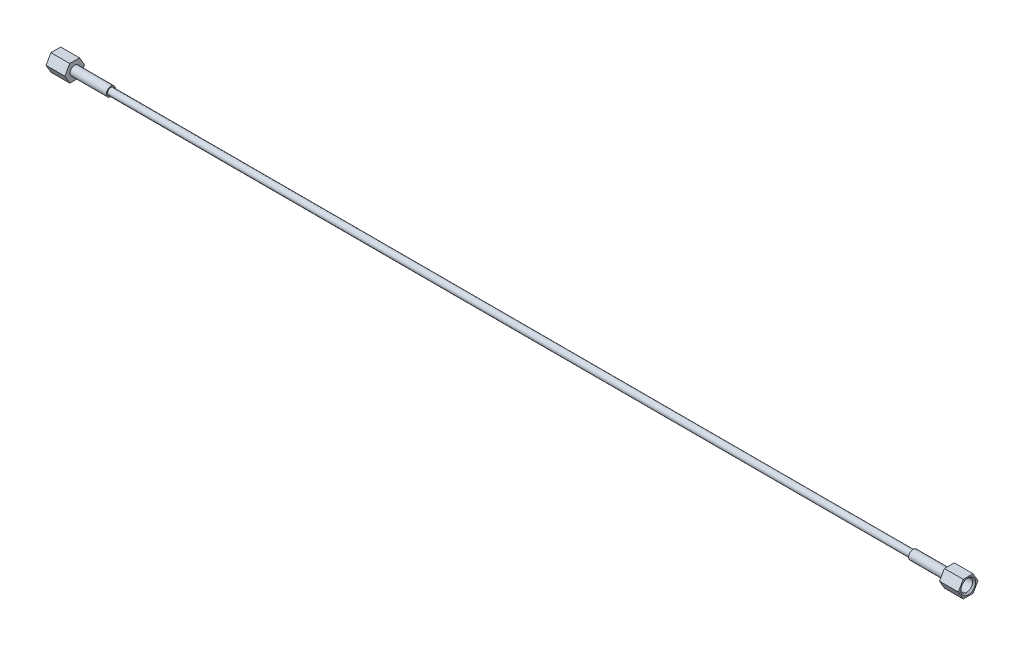
ISO-10303-21;
HEADER;
FILE_DESCRIPTION(('STEP AP214'),'2;1');
FILE_NAME('part.step','',(''),(''),'','','');
FILE_SCHEMA(('AUTOMOTIVE_DESIGN { 1 0 10303 214 1 1 1 1 }'));
ENDSEC;
DATA;
#1=APPLICATION_CONTEXT('core data for automotive mechanical design processes');
#2=APPLICATION_PROTOCOL_DEFINITION('international standard','automotive_design',2000,#1);
#3=PRODUCT_CONTEXT('',#1,'mechanical');
#4=PRODUCT('Part','Part','',(#3));
#5=PRODUCT_RELATED_PRODUCT_CATEGORY('part','',(#4));
#6=PRODUCT_DEFINITION_FORMATION('','',#4);
#7=PRODUCT_DEFINITION_CONTEXT('part definition',#1,'design');
#8=PRODUCT_DEFINITION('design','',#6,#7);
#9=PRODUCT_DEFINITION_SHAPE('','',#8);
#10=(LENGTH_UNIT() NAMED_UNIT(*) SI_UNIT(.MILLI.,.METRE.));
#11=(NAMED_UNIT(*) PLANE_ANGLE_UNIT() SI_UNIT($,.RADIAN.));
#12=(NAMED_UNIT(*) SI_UNIT($,.STERADIAN.) SOLID_ANGLE_UNIT());
#13=UNCERTAINTY_MEASURE_WITH_UNIT(LENGTH_MEASURE(1.E-05),#10,'distance_accuracy_value','');
#14=(GEOMETRIC_REPRESENTATION_CONTEXT(3) GLOBAL_UNCERTAINTY_ASSIGNED_CONTEXT((#13)) GLOBAL_UNIT_ASSIGNED_CONTEXT((#10,
#11,#12)) REPRESENTATION_CONTEXT('',''));
#15=CARTESIAN_POINT('',(0.,0.,0.));
#16=DIRECTION('',(0.,0.,1.));
#17=DIRECTION('',(1.,0.,0.));
#18=AXIS2_PLACEMENT_3D('',#15,#16,#17);
#19=CARTESIAN_POINT('',(-753.11,0.,-8.21223022895325));
#20=DIRECTION('',(0.,-0.500000000000001,0.866025403784438));
#21=DIRECTION('',(0.,-0.866025403784438,-0.500000000000001));
#22=AXIS2_PLACEMENT_3D('',#19,#20,#21);
#23=PLANE('',#22);
#24=DIRECTION('',(0.,0.866025403784438,0.500000000000001));
#25=VECTOR('',#24,1.);
#26=CARTESIAN_POINT('',(-737.362,0.,-8.21223022895325));
#27=LINE('',#26,#25);
#28=CARTESIAN_POINT('',(-737.362,0.,-8.21223022895325));
#29=VERTEX_POINT('',#28);
#30=CARTESIAN_POINT('',(-737.362,7.112,-4.10611511447662));
#31=VERTEX_POINT('',#30);
#32=EDGE_CURVE('E128',#29,#31,#27,.T.);
#33=ORIENTED_EDGE('',*,*,#32,.F.);
#34=DIRECTION('',(1.,0.,0.));
#35=VECTOR('',#34,1.);
#36=CARTESIAN_POINT('',(-753.11,0.,-8.21223022895325));
#37=LINE('',#36,#35);
#38=CARTESIAN_POINT('',(-753.11,0.,-8.21223022895325));
#39=VERTEX_POINT('',#38);
#40=EDGE_CURVE('E127',#39,#29,#37,.T.);
#41=ORIENTED_EDGE('',*,*,#40,.F.);
#42=DIRECTION('',(0.,0.866025403784438,0.500000000000001));
#43=VECTOR('',#42,1.);
#44=CARTESIAN_POINT('',(-753.11,0.,-8.21223022895325));
#45=LINE('',#44,#43);
#46=CARTESIAN_POINT('',(-753.11,7.112,-4.10611511447662));
#47=VERTEX_POINT('',#46);
#48=EDGE_CURVE('E141',#39,#47,#45,.T.);
#49=ORIENTED_EDGE('',*,*,#48,.T.);
#50=DIRECTION('',(1.,0.,0.));
#51=VECTOR('',#50,1.);
#52=CARTESIAN_POINT('',(-753.11,7.112,-4.10611511447662));
#53=LINE('',#52,#51);
#54=EDGE_CURVE('E148',#47,#31,#53,.T.);
#55=ORIENTED_EDGE('',*,*,#54,.T.);
#56=EDGE_LOOP('',(#33,#41,#49,#55));
#57=FACE_BOUND('',#56,.T.);
#58=ADVANCED_FACE('F44',(#57),#23,.F.);
#59=CARTESIAN_POINT('',(-753.11,7.112,-4.10611511447662));
#60=DIRECTION('',(0.,-1.,0.));
#61=DIRECTION('',(0.,0.,-1.));
#62=AXIS2_PLACEMENT_3D('',#59,#60,#61);
#63=PLANE('',#62);
#64=DIRECTION('',(0.,0.,1.));
#65=VECTOR('',#64,1.);
#66=CARTESIAN_POINT('',(-737.362,7.112,-4.10611511447662));
#67=LINE('',#66,#65);
#68=CARTESIAN_POINT('',(-737.362,7.112,4.10611511447661));
#69=VERTEX_POINT('',#68);
#70=EDGE_CURVE('E130',#31,#69,#67,.T.);
#71=ORIENTED_EDGE('',*,*,#70,.F.);
#72=ORIENTED_EDGE('',*,*,#54,.F.);
#73=DIRECTION('',(0.,0.,1.));
#74=VECTOR('',#73,1.);
#75=CARTESIAN_POINT('',(-753.11,7.112,-4.10611511447662));
#76=LINE('',#75,#74);
#77=CARTESIAN_POINT('',(-753.11,7.112,4.10611511447661));
#78=VERTEX_POINT('',#77);
#79=EDGE_CURVE('E93',#47,#78,#76,.T.);
#80=ORIENTED_EDGE('',*,*,#79,.T.);
#81=DIRECTION('',(1.,0.,0.));
#82=VECTOR('',#81,1.);
#83=CARTESIAN_POINT('',(-753.11,7.112,4.10611511447661));
#84=LINE('',#83,#82);
#85=EDGE_CURVE('E145',#78,#69,#84,.T.);
#86=ORIENTED_EDGE('',*,*,#85,.T.);
#87=EDGE_LOOP('',(#71,#72,#80,#86));
#88=FACE_BOUND('',#87,.T.);
#89=ADVANCED_FACE('F172',(#88),#63,.F.);
#90=CARTESIAN_POINT('',(-753.11,7.112,4.10611511447661));
#91=DIRECTION('',(0.,-0.500000000000001,-0.866025403784438));
#92=DIRECTION('',(0.,0.866025403784438,-0.500000000000001));
#93=AXIS2_PLACEMENT_3D('',#90,#91,#92);
#94=PLANE('',#93);
#95=DIRECTION('',(0.,-0.866025403784438,0.500000000000001));
#96=VECTOR('',#95,1.);
#97=CARTESIAN_POINT('',(-737.362,7.112,4.10611511447661));
#98=LINE('',#97,#96);
#99=CARTESIAN_POINT('',(-737.362,0.,8.21223022895324));
#100=VERTEX_POINT('',#99);
#101=EDGE_CURVE('E134',#69,#100,#98,.T.);
#102=ORIENTED_EDGE('',*,*,#101,.F.);
#103=ORIENTED_EDGE('',*,*,#85,.F.);
#104=DIRECTION('',(0.,-0.866025403784438,0.500000000000001));
#105=VECTOR('',#104,1.);
#106=CARTESIAN_POINT('',(-753.11,7.112,4.10611511447661));
#107=LINE('',#106,#105);
#108=CARTESIAN_POINT('',(-753.11,0.,8.21223022895324));
#109=VERTEX_POINT('',#108);
#110=EDGE_CURVE('E121',#78,#109,#107,.T.);
#111=ORIENTED_EDGE('',*,*,#110,.T.);
#112=DIRECTION('',(1.,0.,0.));
#113=VECTOR('',#112,1.);
#114=CARTESIAN_POINT('',(-753.11,0.,8.21223022895324));
#115=LINE('',#114,#113);
#116=EDGE_CURVE('E115',#109,#100,#115,.T.);
#117=ORIENTED_EDGE('',*,*,#116,.T.);
#118=EDGE_LOOP('',(#102,#103,#111,#117));
#119=FACE_BOUND('',#118,.T.);
#120=ADVANCED_FACE('F193',(#119),#94,.F.);
#121=CARTESIAN_POINT('',(-753.11,0.,8.21223022895324));
#122=DIRECTION('',(0.,0.500000000000001,-0.866025403784438));
#123=DIRECTION('',(0.,0.866025403784438,0.500000000000001));
#124=AXIS2_PLACEMENT_3D('',#121,#122,#123);
#125=PLANE('',#124);
#126=DIRECTION('',(0.,-0.866025403784438,-0.500000000000001));
#127=VECTOR('',#126,1.);
#128=CARTESIAN_POINT('',(-737.362,0.,8.21223022895324));
#129=LINE('',#128,#127);
#130=CARTESIAN_POINT('',(-737.362,-7.112,4.10611511447661));
#131=VERTEX_POINT('',#130);
#132=EDGE_CURVE('E137',#100,#131,#129,.T.);
#133=ORIENTED_EDGE('',*,*,#132,.F.);
#134=ORIENTED_EDGE('',*,*,#116,.F.);
#135=DIRECTION('',(0.,-0.866025403784438,-0.500000000000001));
#136=VECTOR('',#135,1.);
#137=CARTESIAN_POINT('',(-753.11,0.,8.21223022895324));
#138=LINE('',#137,#136);
#139=CARTESIAN_POINT('',(-753.11,-7.112,4.10611511447661));
#140=VERTEX_POINT('',#139);
#141=EDGE_CURVE('E105',#109,#140,#138,.T.);
#142=ORIENTED_EDGE('',*,*,#141,.T.);
#143=DIRECTION('',(1.,0.,0.));
#144=VECTOR('',#143,1.);
#145=CARTESIAN_POINT('',(-753.11,-7.112,4.10611511447661));
#146=LINE('',#145,#144);
#147=EDGE_CURVE('E110',#140,#131,#146,.T.);
#148=ORIENTED_EDGE('',*,*,#147,.T.);
#149=EDGE_LOOP('',(#133,#134,#142,#148));
#150=FACE_BOUND('',#149,.T.);
#151=ADVANCED_FACE('F118',(#150),#125,.F.);
#152=CARTESIAN_POINT('',(-753.11,-7.112,4.10611511447661));
#153=DIRECTION('',(0.,1.,0.));
#154=DIRECTION('',(0.,0.,1.));
#155=AXIS2_PLACEMENT_3D('',#152,#153,#154);
#156=PLANE('',#155);
#157=DIRECTION('',(0.,0.,-1.));
#158=VECTOR('',#157,1.);
#159=CARTESIAN_POINT('',(-737.362,-7.112,4.10611511447661));
#160=LINE('',#159,#158);
#161=CARTESIAN_POINT('',(-737.362,-7.112,-4.10611511447661));
#162=VERTEX_POINT('',#161);
#163=EDGE_CURVE('E112',#131,#162,#160,.T.);
#164=ORIENTED_EDGE('',*,*,#163,.F.);
#165=ORIENTED_EDGE('',*,*,#147,.F.);
#166=DIRECTION('',(0.,0.,-1.));
#167=VECTOR('',#166,1.);
#168=CARTESIAN_POINT('',(-753.11,-7.112,4.10611511447661));
#169=LINE('',#168,#167);
#170=CARTESIAN_POINT('',(-753.11,-7.112,-4.10611511447661));
#171=VERTEX_POINT('',#170);
#172=EDGE_CURVE('E101',#140,#171,#169,.T.);
#173=ORIENTED_EDGE('',*,*,#172,.T.);
#174=DIRECTION('',(1.,0.,0.));
#175=VECTOR('',#174,1.);
#176=CARTESIAN_POINT('',(-753.11,-7.112,-4.10611511447661));
#177=LINE('',#176,#175);
#178=EDGE_CURVE('E116',#171,#162,#177,.T.);
#179=ORIENTED_EDGE('',*,*,#178,.T.);
#180=EDGE_LOOP('',(#164,#165,#173,#179));
#181=FACE_BOUND('',#180,.T.);
#182=ADVANCED_FACE('F111',(#181),#156,.F.);
#183=CARTESIAN_POINT('',(-753.11,-7.112,-4.10611511447661));
#184=DIRECTION('',(0.,0.500000000000002,0.866025403784438));
#185=DIRECTION('',(0.,-0.866025403784438,0.500000000000001));
#186=AXIS2_PLACEMENT_3D('',#183,#184,#185);
#187=PLANE('',#186);
#188=DIRECTION('',(0.,0.866025403784438,-0.500000000000001));
#189=VECTOR('',#188,1.);
#190=CARTESIAN_POINT('',(-737.362,-7.112,-4.10611511447661));
#191=LINE('',#190,#189);
#192=EDGE_CURVE('E81',#162,#29,#191,.T.);
#193=ORIENTED_EDGE('',*,*,#192,.F.);
#194=ORIENTED_EDGE('',*,*,#178,.F.);
#195=DIRECTION('',(0.,0.866025403784438,-0.500000000000001));
#196=VECTOR('',#195,1.);
#197=CARTESIAN_POINT('',(-753.11,-7.112,-4.10611511447661));
#198=LINE('',#197,#196);
#199=EDGE_CURVE('E61',#171,#39,#198,.T.);
#200=ORIENTED_EDGE('',*,*,#199,.T.);
#201=ORIENTED_EDGE('',*,*,#40,.T.);
#202=EDGE_LOOP('',(#193,#194,#200,#201));
#203=FACE_BOUND('',#202,.T.);
#204=ADVANCED_FACE('F177',(#203),#187,.F.);
#205=CARTESIAN_POINT('',(-753.11,0.,-8.21223022895325));
#206=DIRECTION('',(1.,0.,0.));
#207=DIRECTION('',(0.,0.,1.));
#208=AXIS2_PLACEMENT_3D('',#205,#206,#207);
#209=PLANE('',#208);
#210=CARTESIAN_POINT('',(-753.11,0.,0.));
#211=DIRECTION('',(-1.,0.,0.));
#212=DIRECTION('',(0.,0.,1.));
#213=AXIS2_PLACEMENT_3D('',#210,#211,#212);
#214=CIRCLE('',#213,6.20077499999993);
#215=CARTESIAN_POINT('',(-753.11,0.,6.20077499999993));
#216=VERTEX_POINT('',#215);
#217=EDGE_CURVE('E12',#216,#216,#214,.T.);
#218=ORIENTED_EDGE('',*,*,#217,.F.);
#219=EDGE_LOOP('',(#218));
#220=FACE_BOUND('',#219,.T.);
#221=ORIENTED_EDGE('',*,*,#48,.F.);
#222=ORIENTED_EDGE('',*,*,#199,.F.);
#223=ORIENTED_EDGE('',*,*,#172,.F.);
#224=ORIENTED_EDGE('',*,*,#141,.F.);
#225=ORIENTED_EDGE('',*,*,#110,.F.);
#226=ORIENTED_EDGE('',*,*,#79,.F.);
#227=EDGE_LOOP('',(#221,#222,#223,#224,#225,#226));
#228=FACE_BOUND('',#227,.T.);
#229=ADVANCED_FACE('F103',(#220,#228),#209,.F.);
#230=CARTESIAN_POINT('',(-737.362,0.,-8.21223022895325));
#231=DIRECTION('',(1.,0.,0.));
#232=DIRECTION('',(0.,0.,1.));
#233=AXIS2_PLACEMENT_3D('',#230,#231,#232);
#234=PLANE('',#233);
#235=CARTESIAN_POINT('',(-737.362,0.,0.));
#236=DIRECTION('',(-1.,0.,0.));
#237=DIRECTION('',(0.,0.,1.));
#238=AXIS2_PLACEMENT_3D('',#235,#236,#237);
#239=CIRCLE('',#238,3.83540000000001);
#240=CARTESIAN_POINT('',(-737.362,0.,3.83540000000001));
#241=VERTEX_POINT('',#240);
#242=EDGE_CURVE('E131',#241,#241,#239,.T.);
#243=ORIENTED_EDGE('',*,*,#242,.T.);
#244=EDGE_LOOP('',(#243));
#245=FACE_BOUND('',#244,.T.);
#246=ORIENTED_EDGE('',*,*,#32,.T.);
#247=ORIENTED_EDGE('',*,*,#70,.T.);
#248=ORIENTED_EDGE('',*,*,#101,.T.);
#249=ORIENTED_EDGE('',*,*,#132,.T.);
#250=ORIENTED_EDGE('',*,*,#163,.T.);
#251=ORIENTED_EDGE('',*,*,#192,.T.);
#252=EDGE_LOOP('',(#246,#247,#248,#249,#250,#251));
#253=FACE_BOUND('',#252,.T.);
#254=ADVANCED_FACE('F184',(#245,#253),#234,.T.);
#255=CARTESIAN_POINT('',(-753.11,0.,0.));
#256=DIRECTION('',(-1.,0.,0.));
#257=DIRECTION('',(0.,0.,-1.));
#258=AXIS2_PLACEMENT_3D('',#255,#256,#257);
#259=CYLINDRICAL_SURFACE('',#258,3.83540000000001);
#260=CARTESIAN_POINT('',(-743.543899614258,0.,0.));
#261=DIRECTION('',(1.,0.,0.));
#262=DIRECTION('',(0.,0.,-1.));
#263=AXIS2_PLACEMENT_3D('',#260,#261,#262);
#264=CIRCLE('',#263,3.83540000000001);
#265=CARTESIAN_POINT('',(-743.543899614258,0.,-3.83540000000001));
#266=VERTEX_POINT('',#265);
#267=EDGE_CURVE('E163',#266,#266,#264,.T.);
#268=ORIENTED_EDGE('',*,*,#267,.F.);
#269=EDGE_LOOP('',(#268));
#270=FACE_BOUND('',#269,.T.);
#271=ORIENTED_EDGE('',*,*,#242,.F.);
#272=EDGE_LOOP('',(#271));
#273=FACE_BOUND('',#272,.T.);
#274=ADVANCED_FACE('F227',(#270,#273),#259,.F.);
#275=CARTESIAN_POINT('',(-744.22,0.,0.));
#276=DIRECTION('',(-1.,0.,0.));
#277=DIRECTION('',(0.,0.,-1.));
#278=AXIS2_PLACEMENT_3D('',#275,#276,#277);
#279=CONICAL_SURFACE('',#278,4.96062,1.02974425867667);
#280=ORIENTED_EDGE('',*,*,#267,.T.);
#281=EDGE_LOOP('',(#280));
#282=FACE_BOUND('',#281,.T.);
#283=CARTESIAN_POINT('',(-744.22,0.,0.));
#284=DIRECTION('',(1.,0.,0.));
#285=DIRECTION('',(0.,0.,-1.));
#286=AXIS2_PLACEMENT_3D('',#283,#284,#285);
#287=CIRCLE('',#286,4.96062);
#288=CARTESIAN_POINT('',(-744.22,0.,-4.96062));
#289=VERTEX_POINT('',#288);
#290=EDGE_CURVE('E161',#289,#289,#287,.T.);
#291=ORIENTED_EDGE('',*,*,#290,.F.);
#292=EDGE_LOOP('',(#291));
#293=FACE_BOUND('',#292,.T.);
#294=ADVANCED_FACE('F157',(#282,#293),#279,.F.);
#295=CARTESIAN_POINT('',(-753.11,0.,0.));
#296=DIRECTION('',(-1.,0.,0.));
#297=DIRECTION('',(0.,0.,-1.));
#298=AXIS2_PLACEMENT_3D('',#295,#296,#297);
#299=CYLINDRICAL_SURFACE('',#298,4.96062);
#300=CARTESIAN_POINT('',(-751.869845,0.,0.));
#301=DIRECTION('',(-1.,0.,0.));
#302=DIRECTION('',(0.,0.,1.));
#303=AXIS2_PLACEMENT_3D('',#300,#301,#302);
#304=CIRCLE('',#303,4.96062);
#305=CARTESIAN_POINT('',(-751.869845,0.,4.96062));
#306=VERTEX_POINT('',#305);
#307=EDGE_CURVE('E53',#306,#306,#304,.F.);
#308=ORIENTED_EDGE('',*,*,#307,.F.);
#309=EDGE_LOOP('',(#308));
#310=FACE_BOUND('',#309,.T.);
#311=ORIENTED_EDGE('',*,*,#290,.T.);
#312=EDGE_LOOP('',(#311));
#313=FACE_BOUND('',#312,.T.);
#314=ADVANCED_FACE('F154',(#310,#313),#299,.F.);
#315=CARTESIAN_POINT('',(-751.869845,0.,0.));
#316=DIRECTION('',(-1.,0.,0.));
#317=DIRECTION('',(0.,0.,-1.));
#318=AXIS2_PLACEMENT_3D('',#315,#316,#317);
#319=CONICAL_SURFACE('',#318,4.96062,0.785398163397451);
#320=ORIENTED_EDGE('',*,*,#217,.T.);
#321=EDGE_LOOP('',(#320));
#322=FACE_BOUND('',#321,.T.);
#323=ORIENTED_EDGE('',*,*,#307,.T.);
#324=EDGE_LOOP('',(#323));
#325=FACE_BOUND('',#324,.T.);
#326=ADVANCED_FACE('F46',(#322,#325),#319,.F.);
#327=CLOSED_SHELL('',(#58,#89,#120,#151,#182,#204,#229,#254,#274,#294,#314,#326));
#328=MANIFOLD_SOLID_BREP('B2',#327);
#329=CARTESIAN_POINT('',(-0.691362245465482,0.,0.));
#330=DIRECTION('',(-1.,0.,0.));
#331=DIRECTION('',(0.,0.,1.));
#332=AXIS2_PLACEMENT_3D('',#329,#330,#331);
#333=CYLINDRICAL_SURFACE('',#332,3.81);
#334=CARTESIAN_POINT('',(-0.691362245465465,0.,0.));
#335=DIRECTION('',(-1.,0.,0.));
#336=DIRECTION('',(0.,0.,1.));
#337=AXIS2_PLACEMENT_3D('',#334,#335,#336);
#338=CIRCLE('',#337,3.80999999999999);
#339=CARTESIAN_POINT('',(-0.691362245465465,0.,3.80999999999999));
#340=VERTEX_POINT('',#339);
#341=EDGE_CURVE('E323',#340,#340,#338,.T.);
#342=ORIENTED_EDGE('',*,*,#341,.T.);
#343=EDGE_LOOP('',(#342));
#344=FACE_BOUND('',#343,.T.);
#345=CARTESIAN_POINT('',(-37.084,0.,0.));
#346=DIRECTION('',(-1.,0.,0.));
#347=DIRECTION('',(0.,0.,1.));
#348=AXIS2_PLACEMENT_3D('',#345,#346,#347);
#349=CIRCLE('',#348,3.81);
#350=CARTESIAN_POINT('',(-37.084,0.,3.81));
#351=VERTEX_POINT('',#350);
#352=EDGE_CURVE('E43',#351,#351,#349,.T.);
#353=ORIENTED_EDGE('',*,*,#352,.F.);
#354=EDGE_LOOP('',(#353));
#355=FACE_BOUND('',#354,.T.);
#356=ADVANCED_FACE('F295',(#344,#355),#333,.T.);
#357=CARTESIAN_POINT('',(-37.084,2.76859999999997,0.));
#358=DIRECTION('',(-1.,0.,0.));
#359=DIRECTION('',(0.,0.,1.));
#360=AXIS2_PLACEMENT_3D('',#357,#358,#359);
#361=PLANE('',#360);
#362=ORIENTED_EDGE('',*,*,#352,.T.);
#363=EDGE_LOOP('',(#362));
#364=FACE_BOUND('',#363,.T.);
#365=CARTESIAN_POINT('',(-37.084,0.,0.));
#366=DIRECTION('',(-1.,0.,0.));
#367=DIRECTION('',(0.,0.,1.));
#368=AXIS2_PLACEMENT_3D('',#365,#366,#367);
#369=CIRCLE('',#368,2.76859999999997);
#370=CARTESIAN_POINT('',(-37.084,0.,2.76859999999997));
#371=VERTEX_POINT('',#370);
#372=EDGE_CURVE('E301',#371,#371,#369,.T.);
#373=ORIENTED_EDGE('',*,*,#372,.F.);
#374=EDGE_LOOP('',(#373));
#375=FACE_BOUND('',#374,.T.);
#376=ADVANCED_FACE('F341',(#364,#375),#361,.T.);
#377=CARTESIAN_POINT('',(-0.691362245465482,0.,0.));
#378=DIRECTION('',(-1.,0.,0.));
#379=DIRECTION('',(0.,0.,1.));
#380=AXIS2_PLACEMENT_3D('',#377,#378,#379);
#381=CYLINDRICAL_SURFACE('',#380,2.76860000000002);
#382=ORIENTED_EDGE('',*,*,#372,.T.);
#383=EDGE_LOOP('',(#382));
#384=FACE_BOUND('',#383,.T.);
#385=CARTESIAN_POINT('',(-707.136,0.,0.));
#386=DIRECTION('',(-1.,0.,0.));
#387=DIRECTION('',(0.,0.,1.));
#388=AXIS2_PLACEMENT_3D('',#385,#386,#387);
#389=CIRCLE('',#388,2.76860000000007);
#390=CARTESIAN_POINT('',(-707.136,0.,2.76860000000007));
#391=VERTEX_POINT('',#390);
#392=EDGE_CURVE('E305',#391,#391,#389,.T.);
#393=ORIENTED_EDGE('',*,*,#392,.F.);
#394=EDGE_LOOP('',(#393));
#395=FACE_BOUND('',#394,.T.);
#396=ADVANCED_FACE('F345',(#384,#395),#381,.T.);
#397=CARTESIAN_POINT('',(-707.136,2.76860000000007,0.));
#398=DIRECTION('',(1.,0.,0.));
#399=DIRECTION('',(0.,0.,-1.));
#400=AXIS2_PLACEMENT_3D('',#397,#398,#399);
#401=PLANE('',#400);
#402=ORIENTED_EDGE('',*,*,#392,.T.);
#403=EDGE_LOOP('',(#402));
#404=FACE_BOUND('',#403,.T.);
#405=CARTESIAN_POINT('',(-707.136,0.,0.));
#406=DIRECTION('',(-1.,0.,0.));
#407=DIRECTION('',(0.,0.,1.));
#408=AXIS2_PLACEMENT_3D('',#405,#406,#407);
#409=CIRCLE('',#408,3.81000000000008);
#410=CARTESIAN_POINT('',(-707.136,0.,3.81000000000008));
#411=VERTEX_POINT('',#410);
#412=EDGE_CURVE('E309',#411,#411,#409,.T.);
#413=ORIENTED_EDGE('',*,*,#412,.F.);
#414=EDGE_LOOP('',(#413));
#415=FACE_BOUND('',#414,.T.);
#416=ADVANCED_FACE('F349',(#404,#415),#401,.T.);
#417=CARTESIAN_POINT('',(-0.691362245465482,0.,0.));
#418=DIRECTION('',(-1.,0.,0.));
#419=DIRECTION('',(0.,0.,1.));
#420=AXIS2_PLACEMENT_3D('',#417,#418,#419);
#421=CYLINDRICAL_SURFACE('',#420,3.81000000000008);
#422=ORIENTED_EDGE('',*,*,#412,.T.);
#423=EDGE_LOOP('',(#422));
#424=FACE_BOUND('',#423,.T.);
#425=CARTESIAN_POINT('',(-743.528637754535,0.,0.));
#426=DIRECTION('',(-1.,0.,0.));
#427=DIRECTION('',(0.,0.,1.));
#428=AXIS2_PLACEMENT_3D('',#425,#426,#427);
#429=CIRCLE('',#428,3.81000000000009);
#430=CARTESIAN_POINT('',(-743.528637754535,0.,3.81000000000009));
#431=VERTEX_POINT('',#430);
#432=EDGE_CURVE('E314',#431,#431,#429,.T.);
#433=ORIENTED_EDGE('',*,*,#432,.F.);
#434=EDGE_LOOP('',(#433));
#435=FACE_BOUND('',#434,.T.);
#436=ADVANCED_FACE('F355',(#424,#435),#421,.T.);
#437=CARTESIAN_POINT('',(-741.834571325248,0.,0.));
#438=DIRECTION('',(-1.,0.,0.));
#439=DIRECTION('',(0.,0.,1.));
#440=AXIS2_PLACEMENT_3D('',#437,#438,#439);
#441=CONICAL_SURFACE('',#440,0.990600000000071,1.02974425867664);
#442=ORIENTED_EDGE('',*,*,#432,.T.);
#443=EDGE_LOOP('',(#442));
#444=FACE_BOUND('',#443,.T.);
#445=CARTESIAN_POINT('',(-741.834571325248,0.,0.));
#446=DIRECTION('',(-1.,0.,0.));
#447=DIRECTION('',(0.,0.,1.));
#448=AXIS2_PLACEMENT_3D('',#445,#446,#447);
#449=CIRCLE('',#448,0.990600000000071);
#450=CARTESIAN_POINT('',(-741.834571325248,0.,0.990600000000071));
#451=VERTEX_POINT('',#450);
#452=EDGE_CURVE('E317',#451,#451,#449,.T.);
#453=ORIENTED_EDGE('',*,*,#452,.F.);
#454=EDGE_LOOP('',(#453));
#455=FACE_BOUND('',#454,.T.);
#456=ADVANCED_FACE('F337',(#444,#455),#441,.F.);
#457=CARTESIAN_POINT('',(-0.691362245465482,0.,0.));
#458=DIRECTION('',(-1.,0.,0.));
#459=DIRECTION('',(0.,0.,1.));
#460=AXIS2_PLACEMENT_3D('',#457,#458,#459);
#461=CYLINDRICAL_SURFACE('',#460,0.990600000000026);
#462=ORIENTED_EDGE('',*,*,#452,.T.);
#463=EDGE_LOOP('',(#462));
#464=FACE_BOUND('',#463,.T.);
#465=CARTESIAN_POINT('',(-2.38542867475171,0.,0.));
#466=DIRECTION('',(-1.,0.,0.));
#467=DIRECTION('',(0.,0.,1.));
#468=AXIS2_PLACEMENT_3D('',#465,#466,#467);
#469=CIRCLE('',#468,0.99059999999998);
#470=CARTESIAN_POINT('',(-2.38542867475171,0.,0.99059999999998));
#471=VERTEX_POINT('',#470);
#472=EDGE_CURVE('E320',#471,#471,#469,.T.);
#473=ORIENTED_EDGE('',*,*,#472,.F.);
#474=EDGE_LOOP('',(#473));
#475=FACE_BOUND('',#474,.T.);
#476=ADVANCED_FACE('F331',(#464,#475),#461,.F.);
#477=CARTESIAN_POINT('',(-0.691362245465465,0.,0.));
#478=DIRECTION('',(1.,0.,0.));
#479=DIRECTION('',(0.,0.,-1.));
#480=AXIS2_PLACEMENT_3D('',#477,#478,#479);
#481=CONICAL_SURFACE('',#480,3.80999999999999,1.02974425867667);
#482=ORIENTED_EDGE('',*,*,#472,.T.);
#483=EDGE_LOOP('',(#482));
#484=FACE_BOUND('',#483,.T.);
#485=ORIENTED_EDGE('',*,*,#341,.F.);
#486=EDGE_LOOP('',(#485));
#487=FACE_BOUND('',#486,.T.);
#488=ADVANCED_FACE('F329',(#484,#487),#481,.F.);
#489=CLOSED_SHELL('',(#356,#376,#396,#416,#436,#456,#476,#488));
#490=MANIFOLD_SOLID_BREP('B6',#489);
#491=CARTESIAN_POINT('',(8.89,0.,-8.21223022895325));
#492=DIRECTION('',(0.,-0.500000000000001,0.866025403784438));
#493=DIRECTION('',(0.,-0.866025403784438,-0.500000000000001));
#494=AXIS2_PLACEMENT_3D('',#491,#492,#493);
#495=PLANE('',#494);
#496=DIRECTION('',(0.,0.866025403784438,0.500000000000001));
#497=VECTOR('',#496,1.);
#498=CARTESIAN_POINT('',(-6.858,0.,-8.21223022895325));
#499=LINE('',#498,#497);
#500=CARTESIAN_POINT('',(-6.858,0.,-8.21223022895325));
#501=VERTEX_POINT('',#500);
#502=CARTESIAN_POINT('',(-6.858,7.112,-4.10611511447662));
#503=VERTEX_POINT('',#502);
#504=EDGE_CURVE('E503',#501,#503,#499,.T.);
#505=ORIENTED_EDGE('',*,*,#504,.T.);
#506=DIRECTION('',(-1.,0.,0.));
#507=VECTOR('',#506,1.);
#508=CARTESIAN_POINT('',(8.89,7.112,-4.10611511447662));
#509=LINE('',#508,#507);
#510=CARTESIAN_POINT('',(8.89,7.112,-4.10611511447662));
#511=VERTEX_POINT('',#510);
#512=EDGE_CURVE('E521',#511,#503,#509,.T.);
#513=ORIENTED_EDGE('',*,*,#512,.F.);
#514=DIRECTION('',(0.,0.866025403784438,0.500000000000001));
#515=VECTOR('',#514,1.);
#516=CARTESIAN_POINT('',(8.89,0.,-8.21223022895325));
#517=LINE('',#516,#515);
#518=CARTESIAN_POINT('',(8.89,0.,-8.21223022895325));
#519=VERTEX_POINT('',#518);
#520=EDGE_CURVE('E514',#519,#511,#517,.T.);
#521=ORIENTED_EDGE('',*,*,#520,.F.);
#522=DIRECTION('',(-1.,0.,0.));
#523=VECTOR('',#522,1.);
#524=CARTESIAN_POINT('',(8.89,0.,-8.21223022895325));
#525=LINE('',#524,#523);
#526=EDGE_CURVE('E499',#519,#501,#525,.T.);
#527=ORIENTED_EDGE('',*,*,#526,.T.);
#528=EDGE_LOOP('',(#505,#513,#521,#527));
#529=FACE_BOUND('',#528,.T.);
#530=ADVANCED_FACE('F417',(#529),#495,.F.);
#531=CARTESIAN_POINT('',(8.89,7.112,-4.10611511447662));
#532=DIRECTION('',(0.,-1.,0.));
#533=DIRECTION('',(0.,0.,-1.));
#534=AXIS2_PLACEMENT_3D('',#531,#532,#533);
#535=PLANE('',#534);
#536=DIRECTION('',(0.,0.,1.));
#537=VECTOR('',#536,1.);
#538=CARTESIAN_POINT('',(-6.858,7.112,-4.10611511447662));
#539=LINE('',#538,#537);
#540=CARTESIAN_POINT('',(-6.858,7.112,4.10611511447661));
#541=VERTEX_POINT('',#540);
#542=EDGE_CURVE('E506',#503,#541,#539,.T.);
#543=ORIENTED_EDGE('',*,*,#542,.T.);
#544=DIRECTION('',(-1.,0.,0.));
#545=VECTOR('',#544,1.);
#546=CARTESIAN_POINT('',(8.89,7.112,4.10611511447661));
#547=LINE('',#546,#545);
#548=CARTESIAN_POINT('',(8.89,7.112,4.10611511447661));
#549=VERTEX_POINT('',#548);
#550=EDGE_CURVE('E518',#549,#541,#547,.T.);
#551=ORIENTED_EDGE('',*,*,#550,.F.);
#552=DIRECTION('',(0.,0.,1.));
#553=VECTOR('',#552,1.);
#554=CARTESIAN_POINT('',(8.89,7.112,-4.10611511447662));
#555=LINE('',#554,#553);
#556=EDGE_CURVE('E472',#511,#549,#555,.T.);
#557=ORIENTED_EDGE('',*,*,#556,.F.);
#558=ORIENTED_EDGE('',*,*,#512,.T.);
#559=EDGE_LOOP('',(#543,#551,#557,#558));
#560=FACE_BOUND('',#559,.T.);
#561=ADVANCED_FACE('F537',(#560),#535,.F.);
#562=CARTESIAN_POINT('',(8.89,7.112,4.10611511447661));
#563=DIRECTION('',(0.,-0.500000000000001,-0.866025403784438));
#564=DIRECTION('',(0.,0.866025403784438,-0.500000000000001));
#565=AXIS2_PLACEMENT_3D('',#562,#563,#564);
#566=PLANE('',#565);
#567=DIRECTION('',(0.,-0.866025403784438,0.500000000000001));
#568=VECTOR('',#567,1.);
#569=CARTESIAN_POINT('',(-6.858,7.112,4.10611511447661));
#570=LINE('',#569,#568);
#571=CARTESIAN_POINT('',(-6.858,0.,8.21223022895324));
#572=VERTEX_POINT('',#571);
#573=EDGE_CURVE('E509',#541,#572,#570,.T.);
#574=ORIENTED_EDGE('',*,*,#573,.T.);
#575=DIRECTION('',(-1.,0.,0.));
#576=VECTOR('',#575,1.);
#577=CARTESIAN_POINT('',(8.89,0.,8.21223022895324));
#578=LINE('',#577,#576);
#579=CARTESIAN_POINT('',(8.89,0.,8.21223022895324));
#580=VERTEX_POINT('',#579);
#581=EDGE_CURVE('E494',#580,#572,#578,.T.);
#582=ORIENTED_EDGE('',*,*,#581,.F.);
#583=DIRECTION('',(0.,-0.866025403784438,0.500000000000001));
#584=VECTOR('',#583,1.);
#585=CARTESIAN_POINT('',(8.89,7.112,4.10611511447661));
#586=LINE('',#585,#584);
#587=EDGE_CURVE('E485',#549,#580,#586,.T.);
#588=ORIENTED_EDGE('',*,*,#587,.F.);
#589=ORIENTED_EDGE('',*,*,#550,.T.);
#590=EDGE_LOOP('',(#574,#582,#588,#589));
#591=FACE_BOUND('',#590,.T.);
#592=ADVANCED_FACE('F542',(#591),#566,.F.);
#593=CARTESIAN_POINT('',(8.89,0.,8.21223022895324));
#594=DIRECTION('',(0.,0.500000000000001,-0.866025403784438));
#595=DIRECTION('',(0.,0.866025403784438,0.500000000000001));
#596=AXIS2_PLACEMENT_3D('',#593,#594,#595);
#597=PLANE('',#596);
#598=DIRECTION('',(0.,-0.866025403784438,-0.500000000000001));
#599=VECTOR('',#598,1.);
#600=CARTESIAN_POINT('',(-6.858,0.,8.21223022895324));
#601=LINE('',#600,#599);
#602=CARTESIAN_POINT('',(-6.858,-7.112,4.10611511447661));
#603=VERTEX_POINT('',#602);
#604=EDGE_CURVE('E493',#572,#603,#601,.T.);
#605=ORIENTED_EDGE('',*,*,#604,.T.);
#606=DIRECTION('',(-1.,0.,0.));
#607=VECTOR('',#606,1.);
#608=CARTESIAN_POINT('',(8.89,-7.112,4.10611511447661));
#609=LINE('',#608,#607);
#610=CARTESIAN_POINT('',(8.89,-7.112,4.10611511447661));
#611=VERTEX_POINT('',#610);
#612=EDGE_CURVE('E490',#611,#603,#609,.T.);
#613=ORIENTED_EDGE('',*,*,#612,.F.);
#614=DIRECTION('',(0.,-0.866025403784438,-0.500000000000001));
#615=VECTOR('',#614,1.);
#616=CARTESIAN_POINT('',(8.89,0.,8.21223022895324));
#617=LINE('',#616,#615);
#618=EDGE_CURVE('E479',#580,#611,#617,.T.);
#619=ORIENTED_EDGE('',*,*,#618,.F.);
#620=ORIENTED_EDGE('',*,*,#581,.T.);
#621=EDGE_LOOP('',(#605,#613,#619,#620));
#622=FACE_BOUND('',#621,.T.);
#623=ADVANCED_FACE('F491',(#622),#597,.F.);
#624=CARTESIAN_POINT('',(8.89,-7.112,4.10611511447661));
#625=DIRECTION('',(0.,1.,0.));
#626=DIRECTION('',(0.,0.,1.));
#627=AXIS2_PLACEMENT_3D('',#624,#625,#626);
#628=PLANE('',#627);
#629=DIRECTION('',(0.,0.,-1.));
#630=VECTOR('',#629,1.);
#631=CARTESIAN_POINT('',(-6.858,-7.112,4.10611511447661));
#632=LINE('',#631,#630);
#633=CARTESIAN_POINT('',(-6.858,-7.112,-4.10611511447661));
#634=VERTEX_POINT('',#633);
#635=EDGE_CURVE('E457',#603,#634,#632,.T.);
#636=ORIENTED_EDGE('',*,*,#635,.T.);
#637=DIRECTION('',(-1.,0.,0.));
#638=VECTOR('',#637,1.);
#639=CARTESIAN_POINT('',(8.89,-7.112,-4.10611511447661));
#640=LINE('',#639,#638);
#641=CARTESIAN_POINT('',(8.89,-7.112,-4.10611511447661));
#642=VERTEX_POINT('',#641);
#643=EDGE_CURVE('E495',#642,#634,#640,.T.);
#644=ORIENTED_EDGE('',*,*,#643,.F.);
#645=DIRECTION('',(0.,0.,-1.));
#646=VECTOR('',#645,1.);
#647=CARTESIAN_POINT('',(8.89,-7.112,4.10611511447661));
#648=LINE('',#647,#646);
#649=EDGE_CURVE('E483',#611,#642,#648,.T.);
#650=ORIENTED_EDGE('',*,*,#649,.F.);
#651=ORIENTED_EDGE('',*,*,#612,.T.);
#652=EDGE_LOOP('',(#636,#644,#650,#651));
#653=FACE_BOUND('',#652,.T.);
#654=ADVANCED_FACE('F497',(#653),#628,.F.);
#655=CARTESIAN_POINT('',(8.89,-7.112,-4.10611511447661));
#656=DIRECTION('',(0.,0.500000000000002,0.866025403784438));
#657=DIRECTION('',(0.,-0.866025403784438,0.500000000000001));
#658=AXIS2_PLACEMENT_3D('',#655,#656,#657);
#659=PLANE('',#658);
#660=DIRECTION('',(0.,0.866025403784438,-0.500000000000001));
#661=VECTOR('',#660,1.);
#662=CARTESIAN_POINT('',(-6.858,-7.112,-4.10611511447661));
#663=LINE('',#662,#661);
#664=EDGE_CURVE('E463',#634,#501,#663,.T.);
#665=ORIENTED_EDGE('',*,*,#664,.T.);
#666=ORIENTED_EDGE('',*,*,#526,.F.);
#667=DIRECTION('',(0.,0.866025403784438,-0.500000000000001));
#668=VECTOR('',#667,1.);
#669=CARTESIAN_POINT('',(8.89,-7.112,-4.10611511447661));
#670=LINE('',#669,#668);
#671=EDGE_CURVE('E434',#642,#519,#670,.T.);
#672=ORIENTED_EDGE('',*,*,#671,.F.);
#673=ORIENTED_EDGE('',*,*,#643,.T.);
#674=EDGE_LOOP('',(#665,#666,#672,#673));
#675=FACE_BOUND('',#674,.T.);
#676=ADVANCED_FACE('F552',(#675),#659,.F.);
#677=CARTESIAN_POINT('',(8.89,0.,-8.21223022895325));
#678=DIRECTION('',(-1.,0.,0.));
#679=DIRECTION('',(0.,0.,1.));
#680=AXIS2_PLACEMENT_3D('',#677,#678,#679);
#681=PLANE('',#680);
#682=CARTESIAN_POINT('',(8.89,0.,0.));
#683=DIRECTION('',(-1.,0.,0.));
#684=DIRECTION('',(0.,0.,1.));
#685=AXIS2_PLACEMENT_3D('',#682,#683,#684);
#686=CIRCLE('',#685,6.20077499999993);
#687=CARTESIAN_POINT('',(8.89,0.,6.20077499999993));
#688=VERTEX_POINT('',#687);
#689=EDGE_CURVE('E293',#688,#688,#686,.T.);
#690=ORIENTED_EDGE('',*,*,#689,.T.);
#691=EDGE_LOOP('',(#690));
#692=FACE_BOUND('',#691,.T.);
#693=ORIENTED_EDGE('',*,*,#520,.T.);
#694=ORIENTED_EDGE('',*,*,#556,.T.);
#695=ORIENTED_EDGE('',*,*,#587,.T.);
#696=ORIENTED_EDGE('',*,*,#618,.T.);
#697=ORIENTED_EDGE('',*,*,#649,.T.);
#698=ORIENTED_EDGE('',*,*,#671,.T.);
#699=EDGE_LOOP('',(#693,#694,#695,#696,#697,#698));
#700=FACE_BOUND('',#699,.T.);
#701=ADVANCED_FACE('F481',(#692,#700),#681,.F.);
#702=CARTESIAN_POINT('',(-6.858,0.,-8.21223022895325));
#703=DIRECTION('',(-1.,0.,0.));
#704=DIRECTION('',(0.,0.,1.));
#705=AXIS2_PLACEMENT_3D('',#702,#703,#704);
#706=PLANE('',#705);
#707=CARTESIAN_POINT('',(-6.858,0.,0.));
#708=DIRECTION('',(-1.,0.,0.));
#709=DIRECTION('',(0.,0.,1.));
#710=AXIS2_PLACEMENT_3D('',#707,#708,#709);
#711=CIRCLE('',#710,3.83540000000001);
#712=CARTESIAN_POINT('',(-6.858,0.,3.83540000000001));
#713=VERTEX_POINT('',#712);
#714=EDGE_CURVE('E507',#713,#713,#711,.T.);
#715=ORIENTED_EDGE('',*,*,#714,.F.);
#716=EDGE_LOOP('',(#715));
#717=FACE_BOUND('',#716,.T.);
#718=ORIENTED_EDGE('',*,*,#504,.F.);
#719=ORIENTED_EDGE('',*,*,#664,.F.);
#720=ORIENTED_EDGE('',*,*,#635,.F.);
#721=ORIENTED_EDGE('',*,*,#604,.F.);
#722=ORIENTED_EDGE('',*,*,#573,.F.);
#723=ORIENTED_EDGE('',*,*,#542,.F.);
#724=EDGE_LOOP('',(#718,#719,#720,#721,#722,#723));
#725=FACE_BOUND('',#724,.T.);
#726=ADVANCED_FACE('F555',(#717,#725),#706,.T.);
#727=CARTESIAN_POINT('',(8.89,0.,0.));
#728=DIRECTION('',(1.,0.,0.));
#729=DIRECTION('',(0.,0.,-1.));
#730=AXIS2_PLACEMENT_3D('',#727,#728,#729);
#731=CYLINDRICAL_SURFACE('',#730,3.83540000000001);
#732=CARTESIAN_POINT('',(-0.676100385742156,0.,0.));
#733=DIRECTION('',(1.,0.,0.));
#734=DIRECTION('',(0.,0.,-1.));
#735=AXIS2_PLACEMENT_3D('',#732,#733,#734);
#736=CIRCLE('',#735,3.83540000000001);
#737=CARTESIAN_POINT('',(-0.676100385742156,0.,-3.83540000000001));
#738=VERTEX_POINT('',#737);
#739=EDGE_CURVE('E573',#738,#738,#736,.T.);
#740=ORIENTED_EDGE('',*,*,#739,.T.);
#741=EDGE_LOOP('',(#740));
#742=FACE_BOUND('',#741,.T.);
#743=ORIENTED_EDGE('',*,*,#714,.T.);
#744=EDGE_LOOP('',(#743));
#745=FACE_BOUND('',#744,.T.);
#746=ADVANCED_FACE('F558',(#742,#745),#731,.F.);
#747=CARTESIAN_POINT('',(0.,0.,0.));
#748=DIRECTION('',(1.,0.,0.));
#749=DIRECTION('',(0.,0.,-1.));
#750=AXIS2_PLACEMENT_3D('',#747,#748,#749);
#751=CONICAL_SURFACE('',#750,4.96062,1.02974425867667);
#752=ORIENTED_EDGE('',*,*,#739,.F.);
#753=EDGE_LOOP('',(#752));
#754=FACE_BOUND('',#753,.T.);
#755=CARTESIAN_POINT('',(0.,0.,0.));
#756=DIRECTION('',(1.,0.,0.));
#757=DIRECTION('',(0.,0.,-1.));
#758=AXIS2_PLACEMENT_3D('',#755,#756,#757);
#759=CIRCLE('',#758,4.96062);
#760=CARTESIAN_POINT('',(0.,0.,-4.96062));
#761=VERTEX_POINT('',#760);
#762=EDGE_CURVE('E576',#761,#761,#759,.T.);
#763=ORIENTED_EDGE('',*,*,#762,.T.);
#764=EDGE_LOOP('',(#763));
#765=FACE_BOUND('',#764,.T.);
#766=ADVANCED_FACE('F533',(#754,#765),#751,.F.);
#767=CARTESIAN_POINT('',(8.89,0.,0.));
#768=DIRECTION('',(1.,0.,0.));
#769=DIRECTION('',(0.,0.,-1.));
#770=AXIS2_PLACEMENT_3D('',#767,#768,#769);
#771=CYLINDRICAL_SURFACE('',#770,4.96062);
#772=CARTESIAN_POINT('',(7.64984500000008,0.,0.));
#773=DIRECTION('',(-1.,0.,0.));
#774=DIRECTION('',(0.,0.,1.));
#775=AXIS2_PLACEMENT_3D('',#772,#773,#774);
#776=CIRCLE('',#775,4.96062);
#777=CARTESIAN_POINT('',(7.64984500000008,0.,4.96062));
#778=VERTEX_POINT('',#777);
#779=EDGE_CURVE('E426',#778,#778,#776,.F.);
#780=ORIENTED_EDGE('',*,*,#779,.T.);
#781=EDGE_LOOP('',(#780));
#782=FACE_BOUND('',#781,.T.);
#783=ORIENTED_EDGE('',*,*,#762,.F.);
#784=EDGE_LOOP('',(#783));
#785=FACE_BOUND('',#784,.T.);
#786=ADVANCED_FACE('F525',(#782,#785),#771,.F.);
#787=CARTESIAN_POINT('',(7.64984500000008,0.,0.));
#788=DIRECTION('',(1.,0.,0.));
#789=DIRECTION('',(0.,0.,-1.));
#790=AXIS2_PLACEMENT_3D('',#787,#788,#789);
#791=CONICAL_SURFACE('',#790,4.96062,0.785398163397451);
#792=ORIENTED_EDGE('',*,*,#689,.F.);
#793=EDGE_LOOP('',(#792));
#794=FACE_BOUND('',#793,.T.);
#795=ORIENTED_EDGE('',*,*,#779,.F.);
#796=EDGE_LOOP('',(#795));
#797=FACE_BOUND('',#796,.T.);
#798=ADVANCED_FACE('F419',(#794,#797),#791,.F.);
#799=CLOSED_SHELL('',(#530,#561,#592,#623,#654,#676,#701,#726,#746,#766,#786,#798));
#800=MANIFOLD_SOLID_BREP('B38',#799);
#801=ADVANCED_BREP_SHAPE_REPRESENTATION('',(#18,#328,#490,#800),#14);
#802=SHAPE_DEFINITION_REPRESENTATION(#9,#801);
ENDSEC;
END-ISO-10303-21;
